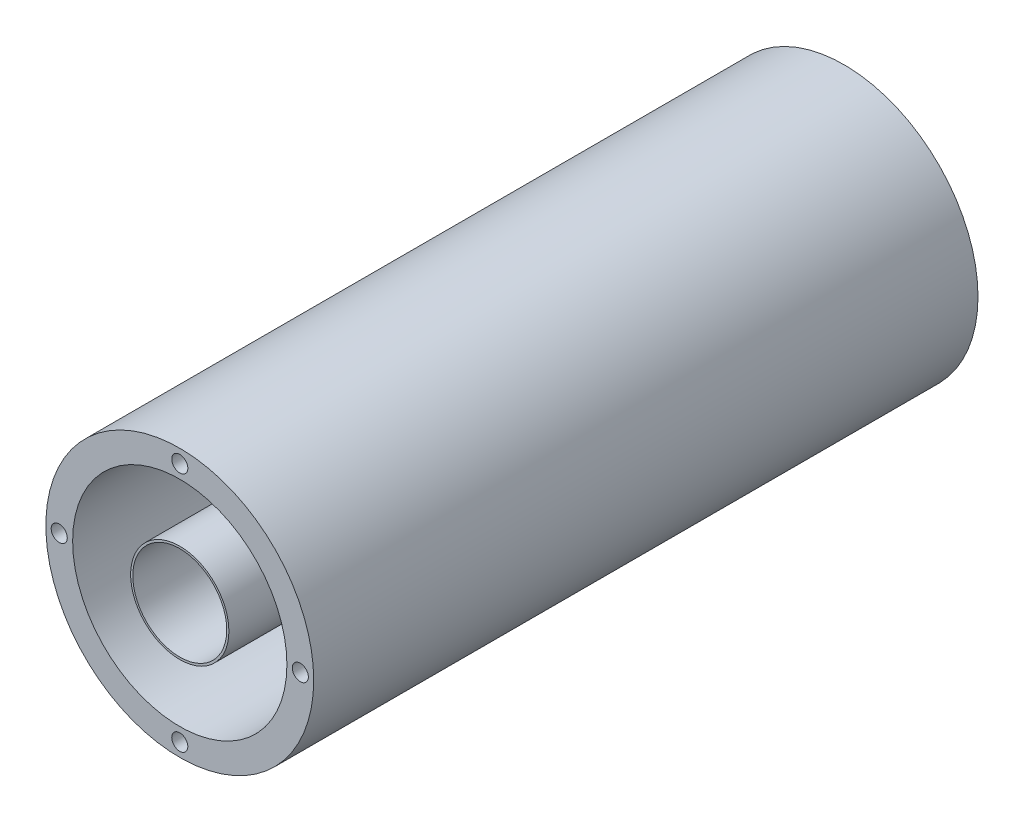
ISO-10303-21;
HEADER;
FILE_DESCRIPTION(('STEP AP214'),'2;1');
FILE_NAME('part.step','',(''),(''),'','','');
FILE_SCHEMA(('AUTOMOTIVE_DESIGN { 1 0 10303 214 1 1 1 1 }'));
ENDSEC;
DATA;
#1=APPLICATION_CONTEXT('core data for automotive mechanical design processes');
#2=APPLICATION_PROTOCOL_DEFINITION('international standard','automotive_design',2000,#1);
#3=PRODUCT_CONTEXT('',#1,'mechanical');
#4=PRODUCT('Part','Part','',(#3));
#5=PRODUCT_RELATED_PRODUCT_CATEGORY('part','',(#4));
#6=PRODUCT_DEFINITION_FORMATION('','',#4);
#7=PRODUCT_DEFINITION_CONTEXT('part definition',#1,'design');
#8=PRODUCT_DEFINITION('design','',#6,#7);
#9=PRODUCT_DEFINITION_SHAPE('','',#8);
#10=(LENGTH_UNIT() NAMED_UNIT(*) SI_UNIT(.MILLI.,.METRE.));
#11=(NAMED_UNIT(*) PLANE_ANGLE_UNIT() SI_UNIT($,.RADIAN.));
#12=(NAMED_UNIT(*) SI_UNIT($,.STERADIAN.) SOLID_ANGLE_UNIT());
#13=UNCERTAINTY_MEASURE_WITH_UNIT(LENGTH_MEASURE(1.E-05),#10,'distance_accuracy_value','');
#14=(GEOMETRIC_REPRESENTATION_CONTEXT(3) GLOBAL_UNCERTAINTY_ASSIGNED_CONTEXT((#13)) GLOBAL_UNIT_ASSIGNED_CONTEXT((#10,
#11,#12)) REPRESENTATION_CONTEXT('',''));
#15=CARTESIAN_POINT('',(0.,0.,0.));
#16=DIRECTION('',(0.,0.,1.));
#17=DIRECTION('',(1.,0.,0.));
#18=AXIS2_PLACEMENT_3D('',#15,#16,#17);
#19=CARTESIAN_POINT('',(0.,0.,4.59999999999999));
#20=DIRECTION('',(0.,0.,1.));
#21=DIRECTION('',(1.,0.,0.));
#22=AXIS2_PLACEMENT_3D('',#19,#20,#21);
#23=CYLINDRICAL_SURFACE('',#22,9.17035962370693);
#24=CARTESIAN_POINT('',(0.,0.,4.59999999999999));
#25=DIRECTION('',(0.,0.,1.));
#26=DIRECTION('',(1.,0.,0.));
#27=AXIS2_PLACEMENT_3D('',#24,#25,#26);
#28=CIRCLE('',#27,9.17035962370693);
#29=CARTESIAN_POINT('',(9.17035962370693,0.,4.59999999999999));
#30=VERTEX_POINT('',#29);
#31=EDGE_CURVE('E11',#30,#30,#28,.T.);
#32=ORIENTED_EDGE('',*,*,#31,.T.);
#33=EDGE_LOOP('',(#32));
#34=FACE_BOUND('',#33,.T.);
#35=CARTESIAN_POINT('',(0.,0.,124.));
#36=DIRECTION('',(0.,0.,1.));
#37=DIRECTION('',(1.,0.,0.));
#38=AXIS2_PLACEMENT_3D('',#35,#36,#37);
#39=CIRCLE('',#38,9.17035962370693);
#40=CARTESIAN_POINT('',(9.17035962370693,0.,124.));
#41=VERTEX_POINT('',#40);
#42=EDGE_CURVE('E46',#41,#41,#39,.T.);
#43=ORIENTED_EDGE('',*,*,#42,.F.);
#44=EDGE_LOOP('',(#43));
#45=FACE_BOUND('',#44,.T.);
#46=ADVANCED_FACE('F43',(#34,#45),#23,.T.);
#47=CARTESIAN_POINT('',(0.,0.,4.59999999999999));
#48=DIRECTION('',(0.,0.,1.));
#49=DIRECTION('',(1.,0.,0.));
#50=AXIS2_PLACEMENT_3D('',#47,#48,#49);
#51=PLANE('',#50);
#52=CARTESIAN_POINT('',(0.,0.,4.59999999999999));
#53=DIRECTION('',(0.,0.,1.));
#54=DIRECTION('',(1.,0.,0.));
#55=AXIS2_PLACEMENT_3D('',#52,#53,#54);
#56=CIRCLE('',#55,8.77035962370694);
#57=CARTESIAN_POINT('',(8.77035962370694,0.,4.59999999999999));
#58=VERTEX_POINT('',#57);
#59=EDGE_CURVE('E53',#58,#58,#56,.T.);
#60=ORIENTED_EDGE('',*,*,#59,.T.);
#61=EDGE_LOOP('',(#60));
#62=FACE_BOUND('',#61,.T.);
#63=ORIENTED_EDGE('',*,*,#31,.F.);
#64=EDGE_LOOP('',(#63));
#65=FACE_BOUND('',#64,.T.);
#66=ADVANCED_FACE('F61',(#62,#65),#51,.F.);
#67=CARTESIAN_POINT('',(0.,0.,124.));
#68=DIRECTION('',(0.,0.,1.));
#69=DIRECTION('',(1.,0.,0.));
#70=AXIS2_PLACEMENT_3D('',#67,#68,#69);
#71=PLANE('',#70);
#72=CARTESIAN_POINT('',(0.,0.,124.));
#73=DIRECTION('',(0.,0.,1.));
#74=DIRECTION('',(1.,0.,0.));
#75=AXIS2_PLACEMENT_3D('',#72,#73,#74);
#76=CIRCLE('',#75,8.77035962370694);
#77=CARTESIAN_POINT('',(8.77035962370694,0.,124.));
#78=VERTEX_POINT('',#77);
#79=EDGE_CURVE('E55',#78,#78,#76,.T.);
#80=ORIENTED_EDGE('',*,*,#79,.F.);
#81=EDGE_LOOP('',(#80));
#82=FACE_BOUND('',#81,.T.);
#83=ORIENTED_EDGE('',*,*,#42,.T.);
#84=EDGE_LOOP('',(#83));
#85=FACE_BOUND('',#84,.T.);
#86=ADVANCED_FACE('F67',(#82,#85),#71,.T.);
#87=CARTESIAN_POINT('',(0.,0.,4.59999999999999));
#88=DIRECTION('',(0.,0.,1.));
#89=DIRECTION('',(1.,0.,0.));
#90=AXIS2_PLACEMENT_3D('',#87,#88,#89);
#91=CYLINDRICAL_SURFACE('',#90,8.77035962370694);
#92=ORIENTED_EDGE('',*,*,#59,.F.);
#93=EDGE_LOOP('',(#92));
#94=FACE_BOUND('',#93,.T.);
#95=ORIENTED_EDGE('',*,*,#79,.T.);
#96=EDGE_LOOP('',(#95));
#97=FACE_BOUND('',#96,.T.);
#98=ADVANCED_FACE('F64',(#94,#97),#91,.F.);
#99=CLOSED_SHELL('',(#46,#66,#86,#98));
#100=MANIFOLD_SOLID_BREP('B2',#99);
#101=CARTESIAN_POINT('',(10.,-7.,-2.));
#102=DIRECTION('',(1.,0.,0.));
#103=DIRECTION('',(0.,0.,-1.));
#104=AXIS2_PLACEMENT_3D('',#101,#102,#103);
#105=CYLINDRICAL_SURFACE('',#104,2.);
#106=DIRECTION('',(-1.,0.,0.));
#107=VECTOR('',#106,1.);
#108=CARTESIAN_POINT('',(-19.5393920141695,-5.,-2.));
#109=LINE('',#108,#107);
#110=CARTESIAN_POINT('',(-5.,-5.,-2.));
#111=VERTEX_POINT('',#110);
#112=CARTESIAN_POINT('',(-13.5393920141695,-5.,-2.));
#113=VERTEX_POINT('',#112);
#114=EDGE_CURVE('E335',#111,#113,#109,.T.);
#115=ORIENTED_EDGE('',*,*,#114,.F.);
#116=CARTESIAN_POINT('',(-5.,-7.,-2.));
#117=DIRECTION('',(-1.,0.,0.));
#118=DIRECTION('',(0.,0.,1.));
#119=AXIS2_PLACEMENT_3D('',#116,#117,#118);
#120=CIRCLE('',#119,2.);
#121=CARTESIAN_POINT('',(-5.,-7.00000000000001,0.));
#122=VERTEX_POINT('',#121);
#123=EDGE_CURVE('E358',#111,#122,#120,.F.);
#124=ORIENTED_EDGE('',*,*,#123,.T.);
#125=DIRECTION('',(-1.,0.,0.));
#126=VECTOR('',#125,1.);
#127=CARTESIAN_POINT('',(19.5393920141695,-7.,0.));
#128=LINE('',#127,#126);
#129=CARTESIAN_POINT('',(-19.5393920141695,-7.,0.));
#130=VERTEX_POINT('',#129);
#131=EDGE_CURVE('E232',#130,#122,#128,.F.);
#132=ORIENTED_EDGE('',*,*,#131,.F.);
#133=CARTESIAN_POINT('',(-13.5393920141695,-5.,-2.));
#134=CARTESIAN_POINT('',(-13.6024383917064,-5.00000452956755,-1.95271371170427));
#135=CARTESIAN_POINT('',(-13.6660295916424,-5.00167638545087,-1.90618652124707));
#136=CARTESIAN_POINT('',(-13.7941720666728,-5.00807140816642,-1.8147304666624));
#137=CARTESIAN_POINT('',(-13.8587230318855,-5.01279361016585,-1.7698011018777));
#138=CARTESIAN_POINT('',(-14.0534216983351,-5.03108828045191,-1.63766217202204));
#139=CARTESIAN_POINT('',(-14.1848682029185,-5.04879111441565,-1.55291214278877));
#140=CARTESIAN_POINT('',(-14.4495007055753,-5.09317476016971,-1.39088096080743));
#141=CARTESIAN_POINT('',(-14.5826688846499,-5.11979393240057,-1.31355309568551));
#142=CARTESIAN_POINT('',(-14.8511637216849,-5.1805475774439,-1.16574737246755));
#143=CARTESIAN_POINT('',(-14.9864917437026,-5.2146869892121,-1.09527406018699));
#144=CARTESIAN_POINT('',(-15.345531344968,-5.31293694909006,-0.918522890278061));
#145=CARTESIAN_POINT('',(-15.5706645701121,-5.38229174299866,-0.818012068778383));
#146=CARTESIAN_POINT('',(-16.0240762638127,-5.53337997243097,-0.635044853932867));
#147=CARTESIAN_POINT('',(-16.2523560251807,-5.61511864278704,-0.552596131903311));
#148=CARTESIAN_POINT('',(-16.7119962990554,-5.78802054164067,-0.404984752850516));
#149=CARTESIAN_POINT('',(-16.9433653497813,-5.87921925176863,-0.339890702477584));
#150=CARTESIAN_POINT('',(-17.4075335163941,-6.06809484378365,-0.226964881391425));
#151=CARTESIAN_POINT('',(-17.6403321490103,-6.16576963521026,-0.179127572057466));
#152=CARTESIAN_POINT('',(-18.147600141761,-6.3828444591993,-0.093429551136681));
#153=CARTESIAN_POINT('',(-18.4222578700728,-6.50306307429278,-0.0587626357568355));
#154=CARTESIAN_POINT('',(-18.9716891418066,-6.74614283833284,-0.0123306041312352));
#155=CARTESIAN_POINT('',(-19.2464612567649,-6.86899797247035,-0.000518014981441167));
#156=CARTESIAN_POINT('',(-19.5272204485023,-6.99455671115761,-5.55846003100709E-06));
#157=CARTESIAN_POINT('',(-19.5333062579821,-6.9972783679514,-3.14340099945249E-09));
#158=CARTESIAN_POINT('',(-19.5393920141695,-7.,0.));
#159=B_SPLINE_CURVE_WITH_KNOTS('',3,(#133,#134,#135,#136,#137,#138,#139,#140,#141,#142,#143,
#144,#145,#146,#147,#148,#149,#150,#151,#152,#153,#154,#155,#156,#157,#158),.UNSPECIFIED.,.F.,
.F.,(4,2,2,2,2,2,2,2,2,2,2,2,4),(0.,0.236371159892356,0.472667591527126,0.944315101860613,
1.41276713949762,1.88152775757089,2.64870335126674,3.41620414998948,4.18669550285118,
4.95693934291842,5.86148159841715,6.76414291697836,6.78414292392342),.UNSPECIFIED.);
#160=EDGE_CURVE('E241',#113,#130,#159,.T.);
#161=ORIENTED_EDGE('',*,*,#160,.F.);
#162=EDGE_LOOP('',(#115,#124,#132,#161));
#163=FACE_BOUND('',#162,.T.);
#164=ADVANCED_FACE('F107',(#163),#105,.F.);
#165=CARTESIAN_POINT('',(10.,7.,-2.));
#166=DIRECTION('',(-1.,0.,0.));
#167=DIRECTION('',(0.,0.,1.));
#168=AXIS2_PLACEMENT_3D('',#165,#166,#167);
#169=CYLINDRICAL_SURFACE('',#168,2.);
#170=DIRECTION('',(1.,0.,0.));
#171=VECTOR('',#170,1.);
#172=CARTESIAN_POINT('',(-19.5393920141695,7.,0.));
#173=LINE('',#172,#171);
#174=CARTESIAN_POINT('',(-5.,7.,0.));
#175=VERTEX_POINT('',#174);
#176=CARTESIAN_POINT('',(-19.5393920141695,7.,0.));
#177=VERTEX_POINT('',#176);
#178=EDGE_CURVE('E230',#175,#177,#173,.F.);
#179=ORIENTED_EDGE('',*,*,#178,.F.);
#180=CARTESIAN_POINT('',(-5.,7.,-2.));
#181=DIRECTION('',(-1.,0.,0.));
#182=DIRECTION('',(0.,0.,1.));
#183=AXIS2_PLACEMENT_3D('',#180,#181,#182);
#184=CIRCLE('',#183,2.);
#185=CARTESIAN_POINT('',(-5.,5.,-2.));
#186=VERTEX_POINT('',#185);
#187=EDGE_CURVE('E116',#175,#186,#184,.F.);
#188=ORIENTED_EDGE('',*,*,#187,.T.);
#189=DIRECTION('',(1.,0.,0.));
#190=VECTOR('',#189,1.);
#191=CARTESIAN_POINT('',(19.5393920141695,5.,-2.));
#192=LINE('',#191,#190);
#193=CARTESIAN_POINT('',(-13.5393920141695,5.,-2.));
#194=VERTEX_POINT('',#193);
#195=EDGE_CURVE('E238',#194,#186,#192,.T.);
#196=ORIENTED_EDGE('',*,*,#195,.F.);
#197=CARTESIAN_POINT('',(-13.5393920141695,5.,-2.));
#198=CARTESIAN_POINT('',(-13.6024383917064,5.00000452956755,-1.95271371170427));
#199=CARTESIAN_POINT('',(-13.6660295916424,5.00167638545087,-1.90618652124707));
#200=CARTESIAN_POINT('',(-13.7941720666728,5.00807140816642,-1.8147304666624));
#201=CARTESIAN_POINT('',(-13.8587230318855,5.01279361016585,-1.7698011018777));
#202=CARTESIAN_POINT('',(-14.0534216983351,5.03108828045191,-1.63766217202204));
#203=CARTESIAN_POINT('',(-14.1848682029185,5.04879111441565,-1.55291214278877));
#204=CARTESIAN_POINT('',(-14.4495007055753,5.09317476016971,-1.39088096080743));
#205=CARTESIAN_POINT('',(-14.5826688846499,5.11979393240057,-1.31355309568551));
#206=CARTESIAN_POINT('',(-14.8511637216849,5.1805475774439,-1.16574737246755));
#207=CARTESIAN_POINT('',(-14.9864917437026,5.2146869892121,-1.09527406018699));
#208=CARTESIAN_POINT('',(-15.345531344968,5.31293694909006,-0.918522890278061));
#209=CARTESIAN_POINT('',(-15.5706645701121,5.38229174299866,-0.818012068778383));
#210=CARTESIAN_POINT('',(-16.0240762638127,5.53337997243097,-0.635044853932867));
#211=CARTESIAN_POINT('',(-16.2523560251807,5.61511864278705,-0.552596131903311));
#212=CARTESIAN_POINT('',(-16.7119962990554,5.78802054164067,-0.404984752850516));
#213=CARTESIAN_POINT('',(-16.9433653497813,5.87921925176863,-0.339890702477584));
#214=CARTESIAN_POINT('',(-17.4075335163941,6.06809484378365,-0.226964881391425));
#215=CARTESIAN_POINT('',(-17.6403321490103,6.16576963521026,-0.179127572057466));
#216=CARTESIAN_POINT('',(-18.147600141761,6.3828444591993,-0.093429551136681));
#217=CARTESIAN_POINT('',(-18.4222578700728,6.50306307429278,-0.0587626357568355));
#218=CARTESIAN_POINT('',(-18.9716891418066,6.74614283833284,-0.0123306041312352));
#219=CARTESIAN_POINT('',(-19.2464612567649,6.86899797247035,-0.000518014981441167));
#220=CARTESIAN_POINT('',(-19.5272204485023,6.99455671115761,-5.55846003100708E-06));
#221=CARTESIAN_POINT('',(-19.5333062579821,6.9972783679514,-3.14340099944622E-09));
#222=CARTESIAN_POINT('',(-19.5393920141695,7.,0.));
#223=B_SPLINE_CURVE_WITH_KNOTS('',3,(#197,#198,#199,#200,#201,#202,#203,#204,#205,#206,#207,
#208,#209,#210,#211,#212,#213,#214,#215,#216,#217,#218,#219,#220,#221,#222),.UNSPECIFIED.,.F.,
.F.,(4,2,2,2,2,2,2,2,2,2,2,2,4),(0.,0.236371159892356,0.472667591527126,0.944315101860613,
1.41276713949762,1.88152775757089,2.64870335126674,3.41620414998948,4.18669550285118,
4.95693934291842,5.86148159841715,6.76414291697836,6.78414292392342),.UNSPECIFIED.);
#224=EDGE_CURVE('E222',#177,#194,#223,.F.);
#225=ORIENTED_EDGE('',*,*,#224,.F.);
#226=EDGE_LOOP('',(#179,#188,#196,#225));
#227=FACE_BOUND('',#226,.T.);
#228=ADVANCED_FACE('F291',(#227),#169,.F.);
#229=CARTESIAN_POINT('',(0.,0.,0.));
#230=DIRECTION('',(0.,0.,1.));
#231=DIRECTION('',(1.,0.,0.));
#232=AXIS2_PLACEMENT_3D('',#229,#230,#231);
#233=PLANE('',#232);
#234=DIRECTION('',(0.,1.,0.));
#235=VECTOR('',#234,1.);
#236=CARTESIAN_POINT('',(-5.,-25.,0.));
#237=LINE('',#236,#235);
#238=EDGE_CURVE('E131',#122,#175,#237,.T.);
#239=ORIENTED_EDGE('',*,*,#238,.T.);
#240=ORIENTED_EDGE('',*,*,#178,.T.);
#241=DIRECTION('',(0.,1.,0.));
#242=VECTOR('',#241,1.);
#243=CARTESIAN_POINT('',(-19.5393920141695,0.,0.));
#244=LINE('',#243,#242);
#245=EDGE_CURVE('E308',#177,#130,#244,.F.);
#246=ORIENTED_EDGE('',*,*,#245,.T.);
#247=ORIENTED_EDGE('',*,*,#131,.T.);
#248=EDGE_LOOP('',(#239,#240,#246,#247));
#249=FACE_BOUND('',#248,.T.);
#250=DIRECTION('',(0.,1.,0.));
#251=VECTOR('',#250,1.);
#252=CARTESIAN_POINT('',(5.,-25.,0.));
#253=LINE('',#252,#251);
#254=CARTESIAN_POINT('',(5.,-7.,0.));
#255=VERTEX_POINT('',#254);
#256=CARTESIAN_POINT('',(5.,6.99999999999999,0.));
#257=VERTEX_POINT('',#256);
#258=EDGE_CURVE('E123',#255,#257,#253,.T.);
#259=ORIENTED_EDGE('',*,*,#258,.F.);
#260=CARTESIAN_POINT('',(19.5393920141695,-7.,0.));
#261=VERTEX_POINT('',#260);
#262=EDGE_CURVE('E229',#255,#261,#128,.F.);
#263=ORIENTED_EDGE('',*,*,#262,.T.);
#264=DIRECTION('',(0.,-1.,0.));
#265=VECTOR('',#264,1.);
#266=CARTESIAN_POINT('',(19.5393920141695,0.,0.));
#267=LINE('',#266,#265);
#268=CARTESIAN_POINT('',(19.5393920141695,7.,0.));
#269=VERTEX_POINT('',#268);
#270=EDGE_CURVE('E227',#261,#269,#267,.F.);
#271=ORIENTED_EDGE('',*,*,#270,.T.);
#272=EDGE_CURVE('E220',#269,#257,#173,.F.);
#273=ORIENTED_EDGE('',*,*,#272,.T.);
#274=EDGE_LOOP('',(#259,#263,#271,#273));
#275=FACE_BOUND('',#274,.T.);
#276=CARTESIAN_POINT('',(0.,0.,0.));
#277=DIRECTION('',(0.,0.,1.));
#278=DIRECTION('',(1.,0.,0.));
#279=AXIS2_PLACEMENT_3D('',#276,#277,#278);
#280=CIRCLE('',#279,25.);
#281=CARTESIAN_POINT('',(25.,0.,0.));
#282=VERTEX_POINT('',#281);
#283=EDGE_CURVE('E375',#282,#282,#280,.T.);
#284=ORIENTED_EDGE('',*,*,#283,.F.);
#285=EDGE_LOOP('',(#284));
#286=FACE_BOUND('',#285,.T.);
#287=ADVANCED_FACE('F224',(#249,#275,#286),#233,.F.);
#288=CARTESIAN_POINT('',(0.,0.,124.));
#289=DIRECTION('',(0.,0.,-1.));
#290=DIRECTION('',(-1.,0.,0.));
#291=AXIS2_PLACEMENT_3D('',#288,#289,#290);
#292=CYLINDRICAL_SURFACE('',#291,25.);
#293=CARTESIAN_POINT('',(0.,0.,124.));
#294=DIRECTION('',(0.,0.,1.));
#295=DIRECTION('',(1.,0.,0.));
#296=AXIS2_PLACEMENT_3D('',#293,#294,#295);
#297=CIRCLE('',#296,25.);
#298=CARTESIAN_POINT('',(25.,0.,124.));
#299=VERTEX_POINT('',#298);
#300=EDGE_CURVE('E378',#299,#299,#297,.T.);
#301=ORIENTED_EDGE('',*,*,#300,.F.);
#302=EDGE_LOOP('',(#301));
#303=FACE_BOUND('',#302,.T.);
#304=ORIENTED_EDGE('',*,*,#283,.T.);
#305=EDGE_LOOP('',(#304));
#306=FACE_BOUND('',#305,.T.);
#307=ADVANCED_FACE('F384',(#303,#306),#292,.T.);
#308=CARTESIAN_POINT('',(0.,0.,124.));
#309=DIRECTION('',(0.,0.,1.));
#310=DIRECTION('',(1.,0.,0.));
#311=AXIS2_PLACEMENT_3D('',#308,#309,#310);
#312=PLANE('',#311);
#313=CARTESIAN_POINT('',(22.5,2.35674990371912E-13,124.));
#314=DIRECTION('',(0.,0.,1.));
#315=DIRECTION('',(0.,-1.,0.));
#316=AXIS2_PLACEMENT_3D('',#313,#314,#315);
#317=CIRCLE('',#316,1.5);
#318=CARTESIAN_POINT('',(22.5,-1.49999999999977,124.));
#319=VERTEX_POINT('',#318);
#320=EDGE_CURVE('E431',#319,#319,#317,.T.);
#321=ORIENTED_EDGE('',*,*,#320,.F.);
#322=EDGE_LOOP('',(#321));
#323=FACE_BOUND('',#322,.T.);
#324=CARTESIAN_POINT('',(0.,-22.5,124.));
#325=DIRECTION('',(0.,0.,1.));
#326=DIRECTION('',(-1.,0.,0.));
#327=AXIS2_PLACEMENT_3D('',#324,#325,#326);
#328=CIRCLE('',#327,1.5);
#329=CARTESIAN_POINT('',(-1.5,-22.5,124.));
#330=VERTEX_POINT('',#329);
#331=EDGE_CURVE('E437',#330,#330,#328,.T.);
#332=ORIENTED_EDGE('',*,*,#331,.F.);
#333=EDGE_LOOP('',(#332));
#334=FACE_BOUND('',#333,.T.);
#335=CARTESIAN_POINT('',(-22.5,0.,124.));
#336=DIRECTION('',(0.,0.,1.));
#337=DIRECTION('',(0.,1.,0.));
#338=AXIS2_PLACEMENT_3D('',#335,#336,#337);
#339=CIRCLE('',#338,1.5);
#340=CARTESIAN_POINT('',(-22.5,1.49999999999992,124.));
#341=VERTEX_POINT('',#340);
#342=EDGE_CURVE('E425',#341,#341,#339,.T.);
#343=ORIENTED_EDGE('',*,*,#342,.F.);
#344=EDGE_LOOP('',(#343));
#345=FACE_BOUND('',#344,.T.);
#346=CARTESIAN_POINT('',(0.,22.5,124.));
#347=DIRECTION('',(0.,0.,1.));
#348=DIRECTION('',(1.,0.,0.));
#349=AXIS2_PLACEMENT_3D('',#346,#347,#348);
#350=CIRCLE('',#349,1.5);
#351=CARTESIAN_POINT('',(1.5,22.5,124.));
#352=VERTEX_POINT('',#351);
#353=EDGE_CURVE('E418',#352,#352,#350,.T.);
#354=ORIENTED_EDGE('',*,*,#353,.F.);
#355=EDGE_LOOP('',(#354));
#356=FACE_BOUND('',#355,.T.);
#357=CARTESIAN_POINT('',(0.,0.,124.));
#358=DIRECTION('',(0.,0.,1.));
#359=DIRECTION('',(1.,0.,0.));
#360=AXIS2_PLACEMENT_3D('',#357,#358,#359);
#361=CIRCLE('',#360,20.);
#362=CARTESIAN_POINT('',(20.,0.,124.));
#363=VERTEX_POINT('',#362);
#364=EDGE_CURVE('E371',#363,#363,#361,.T.);
#365=ORIENTED_EDGE('',*,*,#364,.F.);
#366=EDGE_LOOP('',(#365));
#367=FACE_BOUND('',#366,.T.);
#368=ORIENTED_EDGE('',*,*,#300,.T.);
#369=EDGE_LOOP('',(#368));
#370=FACE_BOUND('',#369,.T.);
#371=ADVANCED_FACE('F391',(#323,#334,#345,#356,#367,#370),#312,.T.);
#372=CARTESIAN_POINT('',(0.,0.,4.));
#373=DIRECTION('',(0.,0.,1.));
#374=DIRECTION('',(1.,0.,0.));
#375=AXIS2_PLACEMENT_3D('',#372,#373,#374);
#376=CYLINDRICAL_SURFACE('',#375,20.);
#377=CARTESIAN_POINT('',(0.,0.,4.));
#378=DIRECTION('',(0.,0.,1.));
#379=DIRECTION('',(1.,0.,0.));
#380=AXIS2_PLACEMENT_3D('',#377,#378,#379);
#381=CIRCLE('',#380,20.);
#382=CARTESIAN_POINT('',(20.,0.,4.));
#383=VERTEX_POINT('',#382);
#384=EDGE_CURVE('E372',#383,#383,#381,.T.);
#385=ORIENTED_EDGE('',*,*,#384,.F.);
#386=EDGE_LOOP('',(#385));
#387=FACE_BOUND('',#386,.T.);
#388=ORIENTED_EDGE('',*,*,#364,.T.);
#389=EDGE_LOOP('',(#388));
#390=FACE_BOUND('',#389,.T.);
#391=ADVANCED_FACE('F454',(#387,#390),#376,.F.);
#392=CARTESIAN_POINT('',(0.,0.,4.));
#393=DIRECTION('',(0.,0.,1.));
#394=DIRECTION('',(1.,0.,0.));
#395=AXIS2_PLACEMENT_3D('',#392,#393,#394);
#396=PLANE('',#395);
#397=ORIENTED_EDGE('',*,*,#384,.T.);
#398=EDGE_LOOP('',(#397));
#399=FACE_BOUND('',#398,.T.);
#400=ADVANCED_FACE('F465',(#399),#396,.T.);
#401=CARTESIAN_POINT('',(10.,5.,-7.));
#402=DIRECTION('',(0.,-1.,0.));
#403=DIRECTION('',(0.,0.,-1.));
#404=AXIS2_PLACEMENT_3D('',#401,#402,#403);
#405=PLANE('',#404);
#406=ORIENTED_EDGE('',*,*,#195,.T.);
#407=DIRECTION('',(0.,0.,-1.));
#408=VECTOR('',#407,1.);
#409=CARTESIAN_POINT('',(-5.,5.,-7.));
#410=LINE('',#409,#408);
#411=CARTESIAN_POINT('',(-5.,4.99999999999999,-3.1));
#412=VERTEX_POINT('',#411);
#413=EDGE_CURVE('E299',#186,#412,#410,.T.);
#414=ORIENTED_EDGE('',*,*,#413,.T.);
#415=DIRECTION('',(1.,0.,0.));
#416=VECTOR('',#415,1.);
#417=CARTESIAN_POINT('',(10.,5.,-3.1));
#418=LINE('',#417,#416);
#419=CARTESIAN_POINT('',(5.,4.99999999999999,-3.1));
#420=VERTEX_POINT('',#419);
#421=EDGE_CURVE('E363',#412,#420,#418,.T.);
#422=ORIENTED_EDGE('',*,*,#421,.T.);
#423=DIRECTION('',(0.,0.,1.));
#424=VECTOR('',#423,1.);
#425=CARTESIAN_POINT('',(5.,5.,-7.));
#426=LINE('',#425,#424);
#427=CARTESIAN_POINT('',(5.,5.,-2.));
#428=VERTEX_POINT('',#427);
#429=EDGE_CURVE('E350',#420,#428,#426,.T.);
#430=ORIENTED_EDGE('',*,*,#429,.T.);
#431=CARTESIAN_POINT('',(13.5393920141695,5.,-2.));
#432=VERTEX_POINT('',#431);
#433=EDGE_CURVE('E221',#428,#432,#192,.T.);
#434=ORIENTED_EDGE('',*,*,#433,.T.);
#435=CARTESIAN_POINT('',(19.5393920141695,5.,-10.));
#436=DIRECTION('',(0.,-1.,0.));
#437=DIRECTION('',(0.,0.,-1.));
#438=AXIS2_PLACEMENT_3D('',#435,#436,#437);
#439=CIRCLE('',#438,10.);
#440=CARTESIAN_POINT('',(11.9400499373841,5.,-3.5));
#441=VERTEX_POINT('',#440);
#442=EDGE_CURVE('E317',#432,#441,#439,.T.);
#443=ORIENTED_EDGE('',*,*,#442,.T.);
#444=CARTESIAN_POINT('',(4.3407078605988,5.,3.));
#445=DIRECTION('',(0.,-1.,0.));
#446=DIRECTION('',(0.,0.,-1.));
#447=AXIS2_PLACEMENT_3D('',#444,#445,#446);
#448=CIRCLE('',#447,10.);
#449=CARTESIAN_POINT('',(4.3407078605988,5.,-7.));
#450=VERTEX_POINT('',#449);
#451=EDGE_CURVE('E325',#441,#450,#448,.F.);
#452=ORIENTED_EDGE('',*,*,#451,.T.);
#453=DIRECTION('',(1.,0.,0.));
#454=VECTOR('',#453,1.);
#455=CARTESIAN_POINT('',(10.,5.,-7.));
#456=LINE('',#455,#454);
#457=CARTESIAN_POINT('',(-4.34070786059879,5.,-7.));
#458=VERTEX_POINT('',#457);
#459=EDGE_CURVE('E365',#458,#450,#456,.T.);
#460=ORIENTED_EDGE('',*,*,#459,.F.);
#461=CARTESIAN_POINT('',(-4.34070786059879,5.,3.));
#462=DIRECTION('',(0.,-1.,0.));
#463=DIRECTION('',(0.,0.,-1.));
#464=AXIS2_PLACEMENT_3D('',#461,#462,#463);
#465=CIRCLE('',#464,10.);
#466=CARTESIAN_POINT('',(-11.9400499373841,5.,-3.5));
#467=VERTEX_POINT('',#466);
#468=EDGE_CURVE('E303',#458,#467,#465,.F.);
#469=ORIENTED_EDGE('',*,*,#468,.T.);
#470=CARTESIAN_POINT('',(-19.5393920141695,5.,-10.));
#471=DIRECTION('',(0.,-1.,0.));
#472=DIRECTION('',(0.,0.,-1.));
#473=AXIS2_PLACEMENT_3D('',#470,#471,#472);
#474=CIRCLE('',#473,10.);
#475=EDGE_CURVE('E301',#467,#194,#474,.T.);
#476=ORIENTED_EDGE('',*,*,#475,.T.);
#477=EDGE_LOOP('',(#406,#414,#422,#430,#434,#443,#452,#460,#469,#476));
#478=FACE_BOUND('',#477,.T.);
#479=ADVANCED_FACE('F297',(#478),#405,.F.);
#480=CARTESIAN_POINT('',(10.,-5.,-7.));
#481=DIRECTION('',(0.,1.,0.));
#482=DIRECTION('',(0.,0.,1.));
#483=AXIS2_PLACEMENT_3D('',#480,#481,#482);
#484=PLANE('',#483);
#485=DIRECTION('',(-1.,0.,0.));
#486=VECTOR('',#485,1.);
#487=CARTESIAN_POINT('',(10.,-5.,-3.1));
#488=LINE('',#487,#486);
#489=CARTESIAN_POINT('',(5.,-5.,-3.1));
#490=VERTEX_POINT('',#489);
#491=CARTESIAN_POINT('',(-5.,-5.,-3.1));
#492=VERTEX_POINT('',#491);
#493=EDGE_CURVE('E41',#490,#492,#488,.T.);
#494=ORIENTED_EDGE('',*,*,#493,.T.);
#495=DIRECTION('',(0.,0.,1.));
#496=VECTOR('',#495,1.);
#497=CARTESIAN_POINT('',(-5.,-5.,-7.));
#498=LINE('',#497,#496);
#499=EDGE_CURVE('E361',#492,#111,#498,.T.);
#500=ORIENTED_EDGE('',*,*,#499,.T.);
#501=ORIENTED_EDGE('',*,*,#114,.T.);
#502=CARTESIAN_POINT('',(-19.5393920141695,-5.,-10.));
#503=DIRECTION('',(0.,1.,0.));
#504=DIRECTION('',(0.,0.,1.));
#505=AXIS2_PLACEMENT_3D('',#502,#503,#504);
#506=CIRCLE('',#505,10.);
#507=CARTESIAN_POINT('',(-11.9400499373841,-5.,-3.5));
#508=VERTEX_POINT('',#507);
#509=EDGE_CURVE('E307',#113,#508,#506,.T.);
#510=ORIENTED_EDGE('',*,*,#509,.T.);
#511=CARTESIAN_POINT('',(-4.34070786059879,-5.,3.));
#512=DIRECTION('',(0.,1.,0.));
#513=DIRECTION('',(0.,0.,1.));
#514=AXIS2_PLACEMENT_3D('',#511,#512,#513);
#515=CIRCLE('',#514,10.);
#516=CARTESIAN_POINT('',(-4.34070786059879,-5.,-7.));
#517=VERTEX_POINT('',#516);
#518=EDGE_CURVE('E332',#508,#517,#515,.F.);
#519=ORIENTED_EDGE('',*,*,#518,.T.);
#520=DIRECTION('',(-1.,0.,0.));
#521=VECTOR('',#520,1.);
#522=CARTESIAN_POINT('',(10.,-5.,-7.));
#523=LINE('',#522,#521);
#524=CARTESIAN_POINT('',(4.34070786059879,-5.,-7.));
#525=VERTEX_POINT('',#524);
#526=EDGE_CURVE('E368',#525,#517,#523,.T.);
#527=ORIENTED_EDGE('',*,*,#526,.F.);
#528=CARTESIAN_POINT('',(4.34070786059879,-5.,3.));
#529=DIRECTION('',(0.,1.,0.));
#530=DIRECTION('',(0.,0.,1.));
#531=AXIS2_PLACEMENT_3D('',#528,#529,#530);
#532=CIRCLE('',#531,10.);
#533=CARTESIAN_POINT('',(11.9400499373841,-5.,-3.5));
#534=VERTEX_POINT('',#533);
#535=EDGE_CURVE('E330',#525,#534,#532,.F.);
#536=ORIENTED_EDGE('',*,*,#535,.T.);
#537=CARTESIAN_POINT('',(19.5393920141695,-5.,-10.));
#538=DIRECTION('',(0.,1.,0.));
#539=DIRECTION('',(0.,0.,1.));
#540=AXIS2_PLACEMENT_3D('',#537,#538,#539);
#541=CIRCLE('',#540,10.);
#542=CARTESIAN_POINT('',(13.5393920141695,-5.,-2.));
#543=VERTEX_POINT('',#542);
#544=EDGE_CURVE('E310',#534,#543,#541,.T.);
#545=ORIENTED_EDGE('',*,*,#544,.T.);
#546=CARTESIAN_POINT('',(5.,-5.,-2.));
#547=VERTEX_POINT('',#546);
#548=EDGE_CURVE('E234',#543,#547,#109,.T.);
#549=ORIENTED_EDGE('',*,*,#548,.T.);
#550=DIRECTION('',(0.,0.,-1.));
#551=VECTOR('',#550,1.);
#552=CARTESIAN_POINT('',(5.,-5.,-7.));
#553=LINE('',#552,#551);
#554=EDGE_CURVE('E348',#547,#490,#553,.T.);
#555=ORIENTED_EDGE('',*,*,#554,.T.);
#556=EDGE_LOOP('',(#494,#500,#501,#510,#519,#527,#536,#545,#549,#555));
#557=FACE_BOUND('',#556,.T.);
#558=ADVANCED_FACE('F347',(#557),#484,.F.);
#559=CARTESIAN_POINT('',(0.,0.,-7.));
#560=DIRECTION('',(0.,0.,-1.));
#561=DIRECTION('',(-1.,0.,0.));
#562=AXIS2_PLACEMENT_3D('',#559,#560,#561);
#563=PLANE('',#562);
#564=ORIENTED_EDGE('',*,*,#526,.T.);
#565=DIRECTION('',(0.,-1.,0.));
#566=VECTOR('',#565,1.);
#567=CARTESIAN_POINT('',(-4.34070786059879,5.,-7.));
#568=LINE('',#567,#566);
#569=EDGE_CURVE('E322',#517,#458,#568,.F.);
#570=ORIENTED_EDGE('',*,*,#569,.T.);
#571=ORIENTED_EDGE('',*,*,#459,.T.);
#572=DIRECTION('',(0.,1.,0.));
#573=VECTOR('',#572,1.);
#574=CARTESIAN_POINT('',(4.34070786059879,-5.,-7.));
#575=LINE('',#574,#573);
#576=EDGE_CURVE('E319',#450,#525,#575,.F.);
#577=ORIENTED_EDGE('',*,*,#576,.T.);
#578=EDGE_LOOP('',(#564,#570,#571,#577));
#579=FACE_BOUND('',#578,.T.);
#580=ADVANCED_FACE('F405',(#579),#563,.T.);
#581=CARTESIAN_POINT('',(-19.5393920141695,5.,-10.));
#582=DIRECTION('',(0.,1.,0.));
#583=DIRECTION('',(0.,0.,1.));
#584=AXIS2_PLACEMENT_3D('',#581,#582,#583);
#585=CYLINDRICAL_SURFACE('',#584,10.);
#586=ORIENTED_EDGE('',*,*,#475,.F.);
#587=DIRECTION('',(0.,1.,0.));
#588=VECTOR('',#587,1.);
#589=CARTESIAN_POINT('',(-11.9400499373841,5.,-3.5));
#590=LINE('',#589,#588);
#591=EDGE_CURVE('E328',#467,#508,#590,.F.);
#592=ORIENTED_EDGE('',*,*,#591,.T.);
#593=ORIENTED_EDGE('',*,*,#509,.F.);
#594=ORIENTED_EDGE('',*,*,#160,.T.);
#595=ORIENTED_EDGE('',*,*,#245,.F.);
#596=ORIENTED_EDGE('',*,*,#224,.T.);
#597=EDGE_LOOP('',(#586,#592,#593,#594,#595,#596));
#598=FACE_BOUND('',#597,.T.);
#599=ADVANCED_FACE('F256',(#598),#585,.F.);
#600=CARTESIAN_POINT('',(19.5393920141695,5.,-10.));
#601=DIRECTION('',(0.,-1.,0.));
#602=DIRECTION('',(1.,0.,0.));
#603=AXIS2_PLACEMENT_3D('',#600,#601,#602);
#604=CYLINDRICAL_SURFACE('',#603,10.);
#605=ORIENTED_EDGE('',*,*,#544,.F.);
#606=DIRECTION('',(0.,-1.,0.));
#607=VECTOR('',#606,1.);
#608=CARTESIAN_POINT('',(11.9400499373841,5.,-3.5));
#609=LINE('',#608,#607);
#610=EDGE_CURVE('E333',#534,#441,#609,.F.);
#611=ORIENTED_EDGE('',*,*,#610,.T.);
#612=ORIENTED_EDGE('',*,*,#442,.F.);
#613=CARTESIAN_POINT('',(13.5393920141695,5.,-2.));
#614=CARTESIAN_POINT('',(13.6024383917064,5.00000452956755,-1.95271371170427));
#615=CARTESIAN_POINT('',(13.6660295916424,5.00167638545087,-1.90618652124708));
#616=CARTESIAN_POINT('',(13.7941720666728,5.00807140816642,-1.81473046666241));
#617=CARTESIAN_POINT('',(13.8587230318855,5.01279361016585,-1.76980110187771));
#618=CARTESIAN_POINT('',(14.0534216983351,5.03108828045191,-1.63766217202206));
#619=CARTESIAN_POINT('',(14.1848682029184,5.04879111441565,-1.5529121427888));
#620=CARTESIAN_POINT('',(14.4495007055753,5.0931747601697,-1.39088096080745));
#621=CARTESIAN_POINT('',(14.5826688846499,5.11979393240056,-1.31355309568553));
#622=CARTESIAN_POINT('',(14.8511637216849,5.1805475774439,-1.16574737246755));
#623=CARTESIAN_POINT('',(14.9864917437026,5.2146869892121,-1.095274060187));
#624=CARTESIAN_POINT('',(15.345531344968,5.31293694909006,-0.91852289027806));
#625=CARTESIAN_POINT('',(15.5706645701121,5.38229174299866,-0.818012068778377));
#626=CARTESIAN_POINT('',(16.0240762638127,5.53337997243098,-0.635044853932858));
#627=CARTESIAN_POINT('',(16.2523560251807,5.61511864278706,-0.552596131903302));
#628=CARTESIAN_POINT('',(16.7119962990554,5.78802054164068,-0.404984752850509));
#629=CARTESIAN_POINT('',(16.9433653497814,5.87921925176862,-0.339890702477579));
#630=CARTESIAN_POINT('',(17.4075335163941,6.06809484378366,-0.226964881391422));
#631=CARTESIAN_POINT('',(17.6403321490103,6.1657696352103,-0.179127572057465));
#632=CARTESIAN_POINT('',(18.1476001417611,6.38284445919925,-0.0934295511366814));
#633=CARTESIAN_POINT('',(18.4222578700729,6.50306307429258,-0.058762635756836));
#634=CARTESIAN_POINT('',(18.9716891418066,6.74614283833304,-0.012330604131235));
#635=CARTESIAN_POINT('',(19.2464612567645,6.86899797247111,-0.000518014981440281));
#636=CARTESIAN_POINT('',(19.5272204485023,6.99455671115764,-5.55846003096884E-06));
#637=CARTESIAN_POINT('',(19.5333062579821,6.99727836795141,-3.14340098031341E-09));
#638=CARTESIAN_POINT('',(19.5393920141695,7.,0.));
#639=B_SPLINE_CURVE_WITH_KNOTS('',3,(#613,#614,#615,#616,#617,#618,#619,#620,#621,#622,#623,
#624,#625,#626,#627,#628,#629,#630,#631,#632,#633,#634,#635,#636,#637,#638),.UNSPECIFIED.,.F.,
.F.,(4,2,2,2,2,2,2,2,2,2,2,2,4),(0.,0.236371159892343,0.472667591527105,0.944315101860567,
1.41276713949759,1.88152775757089,2.64870335126675,3.4162041499895,4.18669550285119,
4.95693934291842,5.86148159841715,6.76414291697836,6.78414292392342),.UNSPECIFIED.);
#640=EDGE_CURVE('E277',#432,#269,#639,.T.);
#641=ORIENTED_EDGE('',*,*,#640,.T.);
#642=ORIENTED_EDGE('',*,*,#270,.F.);
#643=CARTESIAN_POINT('',(13.5393920141695,-5.,-2.));
#644=CARTESIAN_POINT('',(13.6024383917064,-5.00000452956755,-1.95271371170427));
#645=CARTESIAN_POINT('',(13.6660295916424,-5.00167638545087,-1.90618652124708));
#646=CARTESIAN_POINT('',(13.7941720666728,-5.00807140816642,-1.8147304666624));
#647=CARTESIAN_POINT('',(13.8587230318855,-5.01279361016585,-1.76980110187771));
#648=CARTESIAN_POINT('',(14.0534216983351,-5.03108828045191,-1.63766217202204));
#649=CARTESIAN_POINT('',(14.1848682029184,-5.04879111441565,-1.55291214278878));
#650=CARTESIAN_POINT('',(14.4495007055753,-5.09317476016971,-1.39088096080743));
#651=CARTESIAN_POINT('',(14.5826688846499,-5.11979393240057,-1.31355309568551));
#652=CARTESIAN_POINT('',(14.8511637216849,-5.1805475774439,-1.16574737246755));
#653=CARTESIAN_POINT('',(14.9864917437026,-5.21468698921209,-1.095274060187));
#654=CARTESIAN_POINT('',(15.345531344968,-5.31293694909005,-0.918522890278064));
#655=CARTESIAN_POINT('',(15.5706645701121,-5.38229174299866,-0.818012068778385));
#656=CARTESIAN_POINT('',(16.0240762638127,-5.53337997243097,-0.635044853932868));
#657=CARTESIAN_POINT('',(16.2523560251807,-5.61511864278704,-0.552596131903312));
#658=CARTESIAN_POINT('',(16.7119962990554,-5.78802054164067,-0.404984752850517));
#659=CARTESIAN_POINT('',(16.9433653497813,-5.87921925176862,-0.339890702477585));
#660=CARTESIAN_POINT('',(17.4075335163941,-6.06809484378365,-0.226964881391426));
#661=CARTESIAN_POINT('',(17.6403321490103,-6.16576963521027,-0.179127572057466));
#662=CARTESIAN_POINT('',(18.147600141761,-6.38284445919929,-0.0934295511366813));
#663=CARTESIAN_POINT('',(18.4222578700728,-6.50306307429273,-0.0587626357568362));
#664=CARTESIAN_POINT('',(18.9716891418066,-6.74614283833287,-0.0123306041312364));
#665=CARTESIAN_POINT('',(19.2464612567648,-6.86899797247049,-0.000518014981442502));
#666=CARTESIAN_POINT('',(19.5272204485023,-6.99455671115762,-5.55846003106496E-06));
#667=CARTESIAN_POINT('',(19.5333062579821,-6.9972783679514,-3.14340102895592E-09));
#668=CARTESIAN_POINT('',(19.5393920141695,-7.,0.));
#669=B_SPLINE_CURVE_WITH_KNOTS('',3,(#643,#644,#645,#646,#647,#648,#649,#650,#651,#652,#653,
#654,#655,#656,#657,#658,#659,#660,#661,#662,#663,#664,#665,#666,#667,#668),.UNSPECIFIED.,.F.,
.F.,(4,2,2,2,2,2,2,2,2,2,2,2,4),(0.,0.236371159892352,0.472667591527118,0.9443151018606,
1.41276713949761,1.88152775757088,2.64870335126673,3.41620414998948,4.18669550285118,
4.95693934291841,5.86148159841715,6.76414291697836,6.78414292392341),.UNSPECIFIED.);
#670=EDGE_CURVE('E249',#261,#543,#669,.F.);
#671=ORIENTED_EDGE('',*,*,#670,.T.);
#672=EDGE_LOOP('',(#605,#611,#612,#641,#642,#671));
#673=FACE_BOUND('',#672,.T.);
#674=ADVANCED_FACE('F271',(#673),#604,.F.);
#675=CARTESIAN_POINT('',(-4.34070786059879,5.,3.));
#676=DIRECTION('',(0.,1.,0.));
#677=DIRECTION('',(0.,0.,1.));
#678=AXIS2_PLACEMENT_3D('',#675,#676,#677);
#679=CYLINDRICAL_SURFACE('',#678,10.);
#680=ORIENTED_EDGE('',*,*,#518,.F.);
#681=ORIENTED_EDGE('',*,*,#591,.F.);
#682=ORIENTED_EDGE('',*,*,#468,.F.);
#683=ORIENTED_EDGE('',*,*,#569,.F.);
#684=EDGE_LOOP('',(#680,#681,#682,#683));
#685=FACE_BOUND('',#684,.T.);
#686=ADVANCED_FACE('F268',(#685),#679,.T.);
#687=CARTESIAN_POINT('',(4.3407078605988,5.,3.));
#688=DIRECTION('',(0.,-1.,0.));
#689=DIRECTION('',(1.,0.,0.));
#690=AXIS2_PLACEMENT_3D('',#687,#688,#689);
#691=CYLINDRICAL_SURFACE('',#690,10.);
#692=ORIENTED_EDGE('',*,*,#451,.F.);
#693=ORIENTED_EDGE('',*,*,#610,.F.);
#694=ORIENTED_EDGE('',*,*,#535,.F.);
#695=ORIENTED_EDGE('',*,*,#576,.F.);
#696=EDGE_LOOP('',(#692,#693,#694,#695));
#697=FACE_BOUND('',#696,.T.);
#698=ADVANCED_FACE('F263',(#697),#691,.T.);
#699=ORIENTED_EDGE('',*,*,#262,.F.);
#700=CARTESIAN_POINT('',(5.,-7.,-2.));
#701=DIRECTION('',(1.,0.,0.));
#702=DIRECTION('',(0.,0.,-1.));
#703=AXIS2_PLACEMENT_3D('',#700,#701,#702);
#704=CIRCLE('',#703,2.);
#705=EDGE_CURVE('E212',#255,#547,#704,.F.);
#706=ORIENTED_EDGE('',*,*,#705,.T.);
#707=ORIENTED_EDGE('',*,*,#548,.F.);
#708=ORIENTED_EDGE('',*,*,#670,.F.);
#709=EDGE_LOOP('',(#699,#706,#707,#708));
#710=FACE_BOUND('',#709,.T.);
#711=ADVANCED_FACE('F259',(#710),#105,.F.);
#712=ORIENTED_EDGE('',*,*,#433,.F.);
#713=CARTESIAN_POINT('',(5.,7.,-2.));
#714=DIRECTION('',(1.,0.,0.));
#715=DIRECTION('',(0.,0.,-1.));
#716=AXIS2_PLACEMENT_3D('',#713,#714,#715);
#717=CIRCLE('',#716,2.);
#718=EDGE_CURVE('E209',#428,#257,#717,.F.);
#719=ORIENTED_EDGE('',*,*,#718,.T.);
#720=ORIENTED_EDGE('',*,*,#272,.F.);
#721=ORIENTED_EDGE('',*,*,#640,.F.);
#722=EDGE_LOOP('',(#712,#719,#720,#721));
#723=FACE_BOUND('',#722,.T.);
#724=ADVANCED_FACE('F109',(#723),#169,.F.);
#725=CARTESIAN_POINT('',(-5.,-25.,-3.1));
#726=DIRECTION('',(0.,0.,-1.));
#727=DIRECTION('',(-1.,0.,0.));
#728=AXIS2_PLACEMENT_3D('',#725,#726,#727);
#729=PLANE('',#728);
#730=DIRECTION('',(0.,1.,0.));
#731=VECTOR('',#730,1.);
#732=CARTESIAN_POINT('',(-5.,-25.,-3.1));
#733=LINE('',#732,#731);
#734=EDGE_CURVE('E353',#492,#412,#733,.T.);
#735=ORIENTED_EDGE('',*,*,#734,.F.);
#736=ORIENTED_EDGE('',*,*,#493,.F.);
#737=DIRECTION('',(0.,1.,0.));
#738=VECTOR('',#737,1.);
#739=CARTESIAN_POINT('',(5.,-25.,-3.1));
#740=LINE('',#739,#738);
#741=EDGE_CURVE('E214',#490,#420,#740,.T.);
#742=ORIENTED_EDGE('',*,*,#741,.T.);
#743=ORIENTED_EDGE('',*,*,#421,.F.);
#744=EDGE_LOOP('',(#735,#736,#742,#743));
#745=FACE_BOUND('',#744,.T.);
#746=ADVANCED_FACE('F411',(#745),#729,.F.);
#747=CARTESIAN_POINT('',(-5.,-25.,0.));
#748=DIRECTION('',(-1.,0.,0.));
#749=DIRECTION('',(0.,0.,1.));
#750=AXIS2_PLACEMENT_3D('',#747,#748,#749);
#751=PLANE('',#750);
#752=ORIENTED_EDGE('',*,*,#734,.T.);
#753=ORIENTED_EDGE('',*,*,#413,.F.);
#754=ORIENTED_EDGE('',*,*,#187,.F.);
#755=ORIENTED_EDGE('',*,*,#238,.F.);
#756=ORIENTED_EDGE('',*,*,#123,.F.);
#757=ORIENTED_EDGE('',*,*,#499,.F.);
#758=EDGE_LOOP('',(#752,#753,#754,#755,#756,#757));
#759=FACE_BOUND('',#758,.T.);
#760=ADVANCED_FACE('F481',(#759),#751,.F.);
#761=CARTESIAN_POINT('',(5.,-25.,0.));
#762=DIRECTION('',(1.,0.,0.));
#763=DIRECTION('',(0.,0.,-1.));
#764=AXIS2_PLACEMENT_3D('',#761,#762,#763);
#765=PLANE('',#764);
#766=ORIENTED_EDGE('',*,*,#705,.F.);
#767=ORIENTED_EDGE('',*,*,#258,.T.);
#768=ORIENTED_EDGE('',*,*,#718,.F.);
#769=ORIENTED_EDGE('',*,*,#429,.F.);
#770=ORIENTED_EDGE('',*,*,#741,.F.);
#771=ORIENTED_EDGE('',*,*,#554,.F.);
#772=EDGE_LOOP('',(#766,#767,#768,#769,#770,#771));
#773=FACE_BOUND('',#772,.T.);
#774=ADVANCED_FACE('F208',(#773),#765,.F.);
#775=CARTESIAN_POINT('',(0.,22.5,119.));
#776=DIRECTION('',(0.,0.,1.));
#777=DIRECTION('',(1.,0.,0.));
#778=AXIS2_PLACEMENT_3D('',#775,#776,#777);
#779=CYLINDRICAL_SURFACE('',#778,1.5);
#780=CARTESIAN_POINT('',(0.,22.5,119.));
#781=DIRECTION('',(0.,0.,1.));
#782=DIRECTION('',(1.,0.,0.));
#783=AXIS2_PLACEMENT_3D('',#780,#781,#782);
#784=CIRCLE('',#783,1.5);
#785=CARTESIAN_POINT('',(1.5,22.5,119.));
#786=VERTEX_POINT('',#785);
#787=EDGE_CURVE('E416',#786,#786,#784,.T.);
#788=ORIENTED_EDGE('',*,*,#787,.F.);
#789=EDGE_LOOP('',(#788));
#790=FACE_BOUND('',#789,.T.);
#791=ORIENTED_EDGE('',*,*,#353,.T.);
#792=EDGE_LOOP('',(#791));
#793=FACE_BOUND('',#792,.T.);
#794=ADVANCED_FACE('F486',(#790,#793),#779,.F.);
#795=CARTESIAN_POINT('',(0.,22.5,119.));
#796=DIRECTION('',(0.,0.,1.));
#797=DIRECTION('',(1.,0.,0.));
#798=AXIS2_PLACEMENT_3D('',#795,#796,#797);
#799=PLANE('',#798);
#800=ORIENTED_EDGE('',*,*,#787,.T.);
#801=EDGE_LOOP('',(#800));
#802=FACE_BOUND('',#801,.T.);
#803=ADVANCED_FACE('F491',(#802),#799,.T.);
#804=CARTESIAN_POINT('',(-22.5,0.,119.));
#805=DIRECTION('',(0.,0.,1.));
#806=DIRECTION('',(1.,0.,0.));
#807=AXIS2_PLACEMENT_3D('',#804,#805,#806);
#808=CYLINDRICAL_SURFACE('',#807,1.5);
#809=CARTESIAN_POINT('',(-22.5,0.,119.));
#810=DIRECTION('',(0.,0.,1.));
#811=DIRECTION('',(0.,1.,0.));
#812=AXIS2_PLACEMENT_3D('',#809,#810,#811);
#813=CIRCLE('',#812,1.5);
#814=CARTESIAN_POINT('',(-22.5,1.49999999999992,119.));
#815=VERTEX_POINT('',#814);
#816=EDGE_CURVE('E423',#815,#815,#813,.T.);
#817=ORIENTED_EDGE('',*,*,#816,.F.);
#818=EDGE_LOOP('',(#817));
#819=FACE_BOUND('',#818,.T.);
#820=ORIENTED_EDGE('',*,*,#342,.T.);
#821=EDGE_LOOP('',(#820));
#822=FACE_BOUND('',#821,.T.);
#823=ADVANCED_FACE('F495',(#819,#822),#808,.F.);
#824=CARTESIAN_POINT('',(-22.5,0.,119.));
#825=DIRECTION('',(0.,0.,1.));
#826=DIRECTION('',(0.,1.,0.));
#827=AXIS2_PLACEMENT_3D('',#824,#825,#826);
#828=PLANE('',#827);
#829=ORIENTED_EDGE('',*,*,#816,.T.);
#830=EDGE_LOOP('',(#829));
#831=FACE_BOUND('',#830,.T.);
#832=ADVANCED_FACE('F448',(#831),#828,.T.);
#833=CARTESIAN_POINT('',(0.,-22.5,119.));
#834=DIRECTION('',(0.,0.,1.));
#835=DIRECTION('',(1.,0.,0.));
#836=AXIS2_PLACEMENT_3D('',#833,#834,#835);
#837=CYLINDRICAL_SURFACE('',#836,1.5);
#838=CARTESIAN_POINT('',(0.,-22.5,119.));
#839=DIRECTION('',(0.,0.,1.));
#840=DIRECTION('',(-1.,0.,0.));
#841=AXIS2_PLACEMENT_3D('',#838,#839,#840);
#842=CIRCLE('',#841,1.5);
#843=CARTESIAN_POINT('',(-1.5,-22.5,119.));
#844=VERTEX_POINT('',#843);
#845=EDGE_CURVE('E428',#844,#844,#842,.T.);
#846=ORIENTED_EDGE('',*,*,#845,.F.);
#847=EDGE_LOOP('',(#846));
#848=FACE_BOUND('',#847,.T.);
#849=ORIENTED_EDGE('',*,*,#331,.T.);
#850=EDGE_LOOP('',(#849));
#851=FACE_BOUND('',#850,.T.);
#852=ADVANCED_FACE('F445',(#848,#851),#837,.F.);
#853=CARTESIAN_POINT('',(0.,-22.5,119.));
#854=DIRECTION('',(0.,0.,1.));
#855=DIRECTION('',(-1.,0.,0.));
#856=AXIS2_PLACEMENT_3D('',#853,#854,#855);
#857=PLANE('',#856);
#858=ORIENTED_EDGE('',*,*,#845,.T.);
#859=EDGE_LOOP('',(#858));
#860=FACE_BOUND('',#859,.T.);
#861=ADVANCED_FACE('F443',(#860),#857,.T.);
#862=CARTESIAN_POINT('',(22.5,2.35674990371912E-13,119.));
#863=DIRECTION('',(0.,0.,1.));
#864=DIRECTION('',(1.,0.,0.));
#865=AXIS2_PLACEMENT_3D('',#862,#863,#864);
#866=CYLINDRICAL_SURFACE('',#865,1.5);
#867=CARTESIAN_POINT('',(22.5,2.35674990371912E-13,119.));
#868=DIRECTION('',(0.,0.,1.));
#869=DIRECTION('',(0.,-1.,0.));
#870=AXIS2_PLACEMENT_3D('',#867,#868,#869);
#871=CIRCLE('',#870,1.5);
#872=CARTESIAN_POINT('',(22.5,-1.49999999999977,119.));
#873=VERTEX_POINT('',#872);
#874=EDGE_CURVE('E434',#873,#873,#871,.T.);
#875=ORIENTED_EDGE('',*,*,#874,.F.);
#876=EDGE_LOOP('',(#875));
#877=FACE_BOUND('',#876,.T.);
#878=ORIENTED_EDGE('',*,*,#320,.T.);
#879=EDGE_LOOP('',(#878));
#880=FACE_BOUND('',#879,.T.);
#881=ADVANCED_FACE('F502',(#877,#880),#866,.F.);
#882=CARTESIAN_POINT('',(22.5,2.35674990371912E-13,119.));
#883=DIRECTION('',(0.,0.,1.));
#884=DIRECTION('',(0.,-1.,0.));
#885=AXIS2_PLACEMENT_3D('',#882,#883,#884);
#886=PLANE('',#885);
#887=ORIENTED_EDGE('',*,*,#874,.T.);
#888=EDGE_LOOP('',(#887));
#889=FACE_BOUND('',#888,.T.);
#890=ADVANCED_FACE('F505',(#889),#886,.T.);
#891=CLOSED_SHELL('',(#164,#228,#287,#307,#371,#391,#400,#479,#558,#580,#599,#674,#686,#698,
#711,#724,#746,#760,#774,#794,#803,#823,#832,#852,#861,#881,#890));
#892=MANIFOLD_SOLID_BREP('B6',#891);
#893=ADVANCED_BREP_SHAPE_REPRESENTATION('',(#18,#100,#892),#14);
#894=SHAPE_DEFINITION_REPRESENTATION(#9,#893);
ENDSEC;
END-ISO-10303-21;
